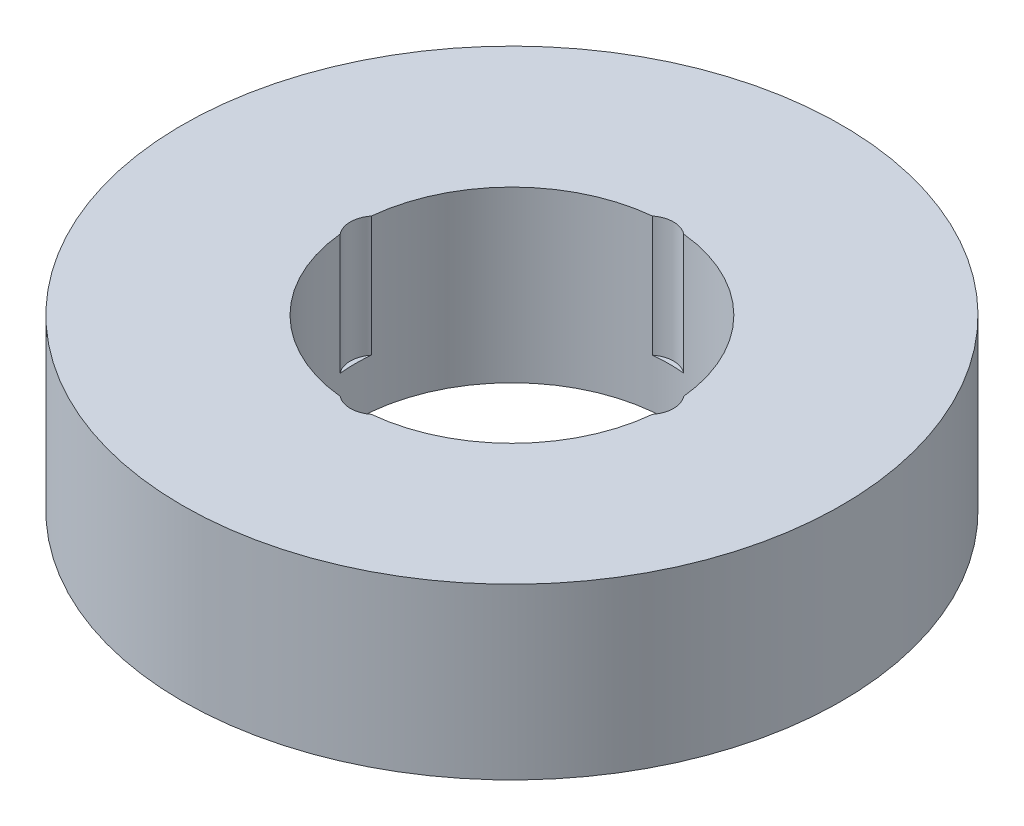
ISO-10303-21;
HEADER;
FILE_DESCRIPTION(('STEP AP214'),'2;1');
FILE_NAME('part.step','',(''),(''),'','','');
FILE_SCHEMA(('AUTOMOTIVE_DESIGN { 1 0 10303 214 1 1 1 1 }'));
ENDSEC;
DATA;
#1=APPLICATION_CONTEXT('core data for automotive mechanical design processes');
#2=APPLICATION_PROTOCOL_DEFINITION('international standard','automotive_design',2000,#1);
#3=PRODUCT_CONTEXT('',#1,'mechanical');
#4=PRODUCT('Part','Part','',(#3));
#5=PRODUCT_RELATED_PRODUCT_CATEGORY('part','',(#4));
#6=PRODUCT_DEFINITION_FORMATION('','',#4);
#7=PRODUCT_DEFINITION_CONTEXT('part definition',#1,'design');
#8=PRODUCT_DEFINITION('design','',#6,#7);
#9=PRODUCT_DEFINITION_SHAPE('','',#8);
#10=(LENGTH_UNIT() NAMED_UNIT(*) SI_UNIT(.MILLI.,.METRE.));
#11=(NAMED_UNIT(*) PLANE_ANGLE_UNIT() SI_UNIT($,.RADIAN.));
#12=(NAMED_UNIT(*) SI_UNIT($,.STERADIAN.) SOLID_ANGLE_UNIT());
#13=UNCERTAINTY_MEASURE_WITH_UNIT(LENGTH_MEASURE(1.E-05),#10,'distance_accuracy_value','');
#14=(GEOMETRIC_REPRESENTATION_CONTEXT(3) GLOBAL_UNCERTAINTY_ASSIGNED_CONTEXT((#13)) GLOBAL_UNIT_ASSIGNED_CONTEXT((#10,
#11,#12)) REPRESENTATION_CONTEXT('',''));
#15=CARTESIAN_POINT('',(0.,0.,0.));
#16=DIRECTION('',(0.,0.,1.));
#17=DIRECTION('',(1.,0.,0.));
#18=AXIS2_PLACEMENT_3D('',#15,#16,#17);
#19=CARTESIAN_POINT('',(0.,27.,0.));
#20=DIRECTION('',(0.,-1.,0.));
#21=DIRECTION('',(0.,0.,-1.));
#22=AXIS2_PLACEMENT_3D('',#19,#20,#21);
#23=CYLINDRICAL_SURFACE('',#22,52.5);
#24=CARTESIAN_POINT('',(0.,27.,0.));
#25=DIRECTION('',(0.,1.,0.));
#26=DIRECTION('',(0.,0.,1.));
#27=AXIS2_PLACEMENT_3D('',#24,#25,#26);
#28=CIRCLE('',#27,52.5);
#29=CARTESIAN_POINT('',(0.,27.,52.5));
#30=VERTEX_POINT('',#29);
#31=EDGE_CURVE('E148',#30,#30,#28,.T.);
#32=ORIENTED_EDGE('',*,*,#31,.F.);
#33=EDGE_LOOP('',(#32));
#34=FACE_BOUND('',#33,.T.);
#35=CARTESIAN_POINT('',(0.,0.,0.));
#36=DIRECTION('',(0.,1.,0.));
#37=DIRECTION('',(0.,0.,1.));
#38=AXIS2_PLACEMENT_3D('',#35,#36,#37);
#39=CIRCLE('',#38,52.5);
#40=CARTESIAN_POINT('',(0.,0.,52.5));
#41=VERTEX_POINT('',#40);
#42=EDGE_CURVE('E139',#41,#41,#39,.T.);
#43=ORIENTED_EDGE('',*,*,#42,.T.);
#44=EDGE_LOOP('',(#43));
#45=FACE_BOUND('',#44,.T.);
#46=ADVANCED_FACE('F39',(#34,#45),#23,.T.);
#47=CARTESIAN_POINT('',(0.,27.,0.));
#48=DIRECTION('',(0.,1.,0.));
#49=DIRECTION('',(0.,0.,1.));
#50=AXIS2_PLACEMENT_3D('',#47,#48,#49);
#51=PLANE('',#50);
#52=CARTESIAN_POINT('',(0.,27.,21.7381492281699));
#53=DIRECTION('',(0.,1.,0.));
#54=DIRECTION('',(1.,0.,0.));
#55=AXIS2_PLACEMENT_3D('',#52,#53,#54);
#56=CIRCLE('',#55,4.00310430508897);
#57=CARTESIAN_POINT('',(-2.48553550810672,27.,24.8761354160557));
#58=VERTEX_POINT('',#57);
#59=CARTESIAN_POINT('',(2.48553550810689,27.,24.8761354160557));
#60=VERTEX_POINT('',#59);
#61=EDGE_CURVE('E175',#58,#60,#56,.T.);
#62=ORIENTED_EDGE('',*,*,#61,.F.);
#63=CARTESIAN_POINT('',(0.,27.,0.));
#64=DIRECTION('',(0.,1.,0.));
#65=DIRECTION('',(0.,0.,1.));
#66=AXIS2_PLACEMENT_3D('',#63,#64,#65);
#67=CIRCLE('',#66,25.);
#68=CARTESIAN_POINT('',(-24.8761354160557,27.,2.4855355081068));
#69=VERTEX_POINT('',#68);
#70=EDGE_CURVE('E134',#69,#58,#67,.T.);
#71=ORIENTED_EDGE('',*,*,#70,.F.);
#72=CARTESIAN_POINT('',(-21.7381492281699,27.,0.));
#73=DIRECTION('',(0.,1.,0.));
#74=DIRECTION('',(0.,0.,1.));
#75=AXIS2_PLACEMENT_3D('',#72,#73,#74);
#76=CIRCLE('',#75,4.00310430508897);
#77=CARTESIAN_POINT('',(-24.8761354160557,27.,-2.4855355081068));
#78=VERTEX_POINT('',#77);
#79=EDGE_CURVE('E143',#78,#69,#76,.T.);
#80=ORIENTED_EDGE('',*,*,#79,.F.);
#81=CARTESIAN_POINT('',(-2.48553550810706,27.,-24.8761354160557));
#82=VERTEX_POINT('',#81);
#83=EDGE_CURVE('E123',#82,#78,#67,.T.);
#84=ORIENTED_EDGE('',*,*,#83,.F.);
#85=CARTESIAN_POINT('',(-2.27695027113427E-13,27.,-21.7381492281699));
#86=DIRECTION('',(0.,1.,0.));
#87=DIRECTION('',(-1.,0.,0.));
#88=AXIS2_PLACEMENT_3D('',#85,#86,#87);
#89=CIRCLE('',#88,4.00310430508897);
#90=CARTESIAN_POINT('',(2.48553550810654,27.,-24.8761354160557));
#91=VERTEX_POINT('',#90);
#92=EDGE_CURVE('E106',#91,#82,#89,.T.);
#93=ORIENTED_EDGE('',*,*,#92,.F.);
#94=CARTESIAN_POINT('',(24.8761354160557,27.,-2.4855355081068));
#95=VERTEX_POINT('',#94);
#96=EDGE_CURVE('E125',#95,#91,#67,.T.);
#97=ORIENTED_EDGE('',*,*,#96,.F.);
#98=CARTESIAN_POINT('',(21.7381492281699,27.,0.));
#99=DIRECTION('',(0.,1.,0.));
#100=DIRECTION('',(0.,0.,-1.));
#101=AXIS2_PLACEMENT_3D('',#98,#99,#100);
#102=CIRCLE('',#101,4.00310430508897);
#103=CARTESIAN_POINT('',(24.8761354160557,27.,2.4855355081068));
#104=VERTEX_POINT('',#103);
#105=EDGE_CURVE('E286',#104,#95,#102,.T.);
#106=ORIENTED_EDGE('',*,*,#105,.F.);
#107=EDGE_CURVE('E135',#60,#104,#67,.T.);
#108=ORIENTED_EDGE('',*,*,#107,.F.);
#109=EDGE_LOOP('',(#62,#71,#80,#84,#93,#97,#106,#108));
#110=FACE_BOUND('',#109,.T.);
#111=ORIENTED_EDGE('',*,*,#31,.T.);
#112=EDGE_LOOP('',(#111));
#113=FACE_BOUND('',#112,.T.);
#114=ADVANCED_FACE('F118',(#110,#113),#51,.T.);
#115=CARTESIAN_POINT('',(0.,0.,0.));
#116=DIRECTION('',(0.,1.,0.));
#117=DIRECTION('',(0.,0.,1.));
#118=AXIS2_PLACEMENT_3D('',#115,#116,#117);
#119=PLANE('',#118);
#120=CARTESIAN_POINT('',(0.,0.,0.));
#121=DIRECTION('',(0.,1.,0.));
#122=DIRECTION('',(0.,0.,1.));
#123=AXIS2_PLACEMENT_3D('',#120,#121,#122);
#124=CIRCLE('',#123,25.);
#125=CARTESIAN_POINT('',(0.,0.,25.));
#126=VERTEX_POINT('',#125);
#127=EDGE_CURVE('E136',#126,#126,#124,.T.);
#128=ORIENTED_EDGE('',*,*,#127,.T.);
#129=EDGE_LOOP('',(#128));
#130=FACE_BOUND('',#129,.T.);
#131=ORIENTED_EDGE('',*,*,#42,.F.);
#132=EDGE_LOOP('',(#131));
#133=FACE_BOUND('',#132,.T.);
#134=ADVANCED_FACE('F187',(#130,#133),#119,.F.);
#135=CARTESIAN_POINT('',(0.,27.,0.));
#136=DIRECTION('',(0.,-1.,0.));
#137=DIRECTION('',(0.,0.,-1.));
#138=AXIS2_PLACEMENT_3D('',#135,#136,#137);
#139=CYLINDRICAL_SURFACE('',#138,25.);
#140=DIRECTION('',(0.,1.,0.));
#141=VECTOR('',#140,1.);
#142=CARTESIAN_POINT('',(-2.48553550810674,17.4033158666836,24.8761354160557));
#143=LINE('',#142,#141);
#144=CARTESIAN_POINT('',(-2.48553550810672,7.8066317333672,24.8761354160557));
#145=VERTEX_POINT('',#144);
#146=EDGE_CURVE('E11',#145,#58,#143,.T.);
#147=ORIENTED_EDGE('',*,*,#146,.F.);
#148=CARTESIAN_POINT('',(0.,7.8066317333672,0.));
#149=DIRECTION('',(0.,1.,0.));
#150=DIRECTION('',(0.,0.,1.));
#151=AXIS2_PLACEMENT_3D('',#148,#149,#150);
#152=CIRCLE('',#151,25.);
#153=CARTESIAN_POINT('',(2.48553550810689,7.8066317333672,24.8761354160557));
#154=VERTEX_POINT('',#153);
#155=EDGE_CURVE('E170',#145,#154,#152,.T.);
#156=ORIENTED_EDGE('',*,*,#155,.T.);
#157=DIRECTION('',(0.,1.,0.));
#158=VECTOR('',#157,1.);
#159=CARTESIAN_POINT('',(2.48553550810691,17.4033158666836,24.8761354160557));
#160=LINE('',#159,#158);
#161=EDGE_CURVE('E46',#60,#154,#160,.F.);
#162=ORIENTED_EDGE('',*,*,#161,.F.);
#163=ORIENTED_EDGE('',*,*,#107,.T.);
#164=DIRECTION('',(0.,1.,0.));
#165=VECTOR('',#164,1.);
#166=CARTESIAN_POINT('',(24.8761354160557,17.4033158666836,2.48553550810683));
#167=LINE('',#166,#165);
#168=CARTESIAN_POINT('',(24.8761354160557,7.8066317333672,2.4855355081068));
#169=VERTEX_POINT('',#168);
#170=EDGE_CURVE('E164',#169,#104,#167,.T.);
#171=ORIENTED_EDGE('',*,*,#170,.F.);
#172=CARTESIAN_POINT('',(0.,7.8066317333672,0.));
#173=DIRECTION('',(0.,1.,0.));
#174=DIRECTION('',(0.,0.,1.));
#175=AXIS2_PLACEMENT_3D('',#172,#173,#174);
#176=CIRCLE('',#175,25.);
#177=CARTESIAN_POINT('',(24.8761354160557,7.8066317333672,-2.4855355081068));
#178=VERTEX_POINT('',#177);
#179=EDGE_CURVE('E115',#169,#178,#176,.T.);
#180=ORIENTED_EDGE('',*,*,#179,.T.);
#181=DIRECTION('',(0.,1.,0.));
#182=VECTOR('',#181,1.);
#183=CARTESIAN_POINT('',(24.8761354160557,17.4033158666836,-2.48553550810683));
#184=LINE('',#183,#182);
#185=EDGE_CURVE('E131',#95,#178,#184,.F.);
#186=ORIENTED_EDGE('',*,*,#185,.F.);
#187=ORIENTED_EDGE('',*,*,#96,.T.);
#188=DIRECTION('',(0.,1.,0.));
#189=VECTOR('',#188,1.);
#190=CARTESIAN_POINT('',(2.48553550810657,17.4033158666836,-24.8761354160557));
#191=LINE('',#190,#189);
#192=CARTESIAN_POINT('',(2.48553550810654,7.8066317333672,-24.8761354160557));
#193=VERTEX_POINT('',#192);
#194=EDGE_CURVE('E105',#193,#91,#191,.T.);
#195=ORIENTED_EDGE('',*,*,#194,.F.);
#196=CARTESIAN_POINT('',(0.,7.8066317333672,0.));
#197=DIRECTION('',(0.,1.,0.));
#198=DIRECTION('',(0.,0.,1.));
#199=AXIS2_PLACEMENT_3D('',#196,#197,#198);
#200=CIRCLE('',#199,25.);
#201=CARTESIAN_POINT('',(-2.48553550810706,7.8066317333672,-24.8761354160557));
#202=VERTEX_POINT('',#201);
#203=EDGE_CURVE('E159',#193,#202,#200,.T.);
#204=ORIENTED_EDGE('',*,*,#203,.T.);
#205=DIRECTION('',(0.,1.,0.));
#206=VECTOR('',#205,1.);
#207=CARTESIAN_POINT('',(-2.48553550810709,17.4033158666836,-24.8761354160556));
#208=LINE('',#207,#206);
#209=EDGE_CURVE('E114',#82,#202,#208,.F.);
#210=ORIENTED_EDGE('',*,*,#209,.F.);
#211=ORIENTED_EDGE('',*,*,#83,.T.);
#212=DIRECTION('',(0.,1.,0.));
#213=VECTOR('',#212,1.);
#214=CARTESIAN_POINT('',(-24.8761354160557,17.4033158666836,-2.48553550810683));
#215=LINE('',#214,#213);
#216=CARTESIAN_POINT('',(-24.8761354160557,7.8066317333672,-2.4855355081068));
#217=VERTEX_POINT('',#216);
#218=EDGE_CURVE('E160',#217,#78,#215,.T.);
#219=ORIENTED_EDGE('',*,*,#218,.F.);
#220=CARTESIAN_POINT('',(0.,7.8066317333672,0.));
#221=DIRECTION('',(0.,1.,0.));
#222=DIRECTION('',(0.,0.,1.));
#223=AXIS2_PLACEMENT_3D('',#220,#221,#222);
#224=CIRCLE('',#223,25.);
#225=CARTESIAN_POINT('',(-24.8761354160557,7.8066317333672,2.4855355081068));
#226=VERTEX_POINT('',#225);
#227=EDGE_CURVE('E149',#217,#226,#224,.T.);
#228=ORIENTED_EDGE('',*,*,#227,.T.);
#229=DIRECTION('',(0.,1.,0.));
#230=VECTOR('',#229,1.);
#231=CARTESIAN_POINT('',(-24.8761354160557,17.4033158666836,2.48553550810683));
#232=LINE('',#231,#230);
#233=EDGE_CURVE('E152',#69,#226,#232,.F.);
#234=ORIENTED_EDGE('',*,*,#233,.F.);
#235=ORIENTED_EDGE('',*,*,#70,.T.);
#236=EDGE_LOOP('',(#147,#156,#162,#163,#171,#180,#186,#187,#195,#204,#210,#211,#219,#228,#234,#235));
#237=FACE_BOUND('',#236,.T.);
#238=ORIENTED_EDGE('',*,*,#127,.F.);
#239=EDGE_LOOP('',(#238));
#240=FACE_BOUND('',#239,.T.);
#241=ADVANCED_FACE('F126',(#237,#240),#139,.F.);
#242=CARTESIAN_POINT('',(-21.7381492281699,7.8066317333672,0.));
#243=DIRECTION('',(0.,1.,0.));
#244=DIRECTION('',(0.,0.,1.));
#245=AXIS2_PLACEMENT_3D('',#242,#243,#244);
#246=CYLINDRICAL_SURFACE('',#245,4.00310430508897);
#247=ORIENTED_EDGE('',*,*,#218,.T.);
#248=ORIENTED_EDGE('',*,*,#79,.T.);
#249=ORIENTED_EDGE('',*,*,#233,.T.);
#250=CARTESIAN_POINT('',(-21.7381492281699,7.8066317333672,0.));
#251=DIRECTION('',(0.,1.,0.));
#252=DIRECTION('',(0.,0.,1.));
#253=AXIS2_PLACEMENT_3D('',#250,#251,#252);
#254=CIRCLE('',#253,4.00310430508897);
#255=EDGE_CURVE('E144',#217,#226,#254,.T.);
#256=ORIENTED_EDGE('',*,*,#255,.F.);
#257=EDGE_LOOP('',(#247,#248,#249,#256));
#258=FACE_BOUND('',#257,.T.);
#259=ADVANCED_FACE('F200',(#258),#246,.F.);
#260=CARTESIAN_POINT('',(-21.7381492281699,7.8066317333672,0.));
#261=DIRECTION('',(0.,1.,0.));
#262=DIRECTION('',(0.,0.,1.));
#263=AXIS2_PLACEMENT_3D('',#260,#261,#262);
#264=PLANE('',#263);
#265=ORIENTED_EDGE('',*,*,#255,.T.);
#266=ORIENTED_EDGE('',*,*,#227,.F.);
#267=EDGE_LOOP('',(#265,#266));
#268=FACE_BOUND('',#267,.T.);
#269=ADVANCED_FACE('F201',(#268),#264,.T.);
#270=CARTESIAN_POINT('',(-2.27695027113427E-13,7.8066317333672,-21.7381492281699));
#271=DIRECTION('',(0.,1.,0.));
#272=DIRECTION('',(0.,0.,1.));
#273=AXIS2_PLACEMENT_3D('',#270,#271,#272);
#274=CYLINDRICAL_SURFACE('',#273,4.00310430508897);
#275=ORIENTED_EDGE('',*,*,#194,.T.);
#276=ORIENTED_EDGE('',*,*,#92,.T.);
#277=ORIENTED_EDGE('',*,*,#209,.T.);
#278=CARTESIAN_POINT('',(-2.27695027113427E-13,7.8066317333672,-21.7381492281699));
#279=DIRECTION('',(0.,1.,0.));
#280=DIRECTION('',(-1.,0.,0.));
#281=AXIS2_PLACEMENT_3D('',#278,#279,#280);
#282=CIRCLE('',#281,4.00310430508897);
#283=EDGE_CURVE('E107',#193,#202,#282,.T.);
#284=ORIENTED_EDGE('',*,*,#283,.F.);
#285=EDGE_LOOP('',(#275,#276,#277,#284));
#286=FACE_BOUND('',#285,.T.);
#287=ADVANCED_FACE('F102',(#286),#274,.F.);
#288=CARTESIAN_POINT('',(-2.27695027113427E-13,7.8066317333672,-21.7381492281699));
#289=DIRECTION('',(0.,1.,0.));
#290=DIRECTION('',(-1.,0.,0.));
#291=AXIS2_PLACEMENT_3D('',#288,#289,#290);
#292=PLANE('',#291);
#293=ORIENTED_EDGE('',*,*,#283,.T.);
#294=ORIENTED_EDGE('',*,*,#203,.F.);
#295=EDGE_LOOP('',(#293,#294));
#296=FACE_BOUND('',#295,.T.);
#297=ADVANCED_FACE('F209',(#296),#292,.T.);
#298=CARTESIAN_POINT('',(21.7381492281699,7.8066317333672,0.));
#299=DIRECTION('',(0.,1.,0.));
#300=DIRECTION('',(0.,0.,1.));
#301=AXIS2_PLACEMENT_3D('',#298,#299,#300);
#302=CYLINDRICAL_SURFACE('',#301,4.00310430508897);
#303=ORIENTED_EDGE('',*,*,#170,.T.);
#304=ORIENTED_EDGE('',*,*,#105,.T.);
#305=ORIENTED_EDGE('',*,*,#185,.T.);
#306=CARTESIAN_POINT('',(21.7381492281699,7.8066317333672,0.));
#307=DIRECTION('',(0.,1.,0.));
#308=DIRECTION('',(0.,0.,-1.));
#309=AXIS2_PLACEMENT_3D('',#306,#307,#308);
#310=CIRCLE('',#309,4.00310430508897);
#311=EDGE_CURVE('E56',#169,#178,#310,.T.);
#312=ORIENTED_EDGE('',*,*,#311,.F.);
#313=EDGE_LOOP('',(#303,#304,#305,#312));
#314=FACE_BOUND('',#313,.T.);
#315=ADVANCED_FACE('F213',(#314),#302,.F.);
#316=CARTESIAN_POINT('',(21.7381492281699,7.8066317333672,0.));
#317=DIRECTION('',(0.,1.,0.));
#318=DIRECTION('',(0.,0.,-1.));
#319=AXIS2_PLACEMENT_3D('',#316,#317,#318);
#320=PLANE('',#319);
#321=ORIENTED_EDGE('',*,*,#311,.T.);
#322=ORIENTED_EDGE('',*,*,#179,.F.);
#323=EDGE_LOOP('',(#321,#322));
#324=FACE_BOUND('',#323,.T.);
#325=ADVANCED_FACE('F179',(#324),#320,.T.);
#326=CARTESIAN_POINT('',(0.,7.8066317333672,21.7381492281699));
#327=DIRECTION('',(0.,1.,0.));
#328=DIRECTION('',(0.,0.,1.));
#329=AXIS2_PLACEMENT_3D('',#326,#327,#328);
#330=CYLINDRICAL_SURFACE('',#329,4.00310430508897);
#331=ORIENTED_EDGE('',*,*,#146,.T.);
#332=ORIENTED_EDGE('',*,*,#61,.T.);
#333=ORIENTED_EDGE('',*,*,#161,.T.);
#334=CARTESIAN_POINT('',(0.,7.8066317333672,21.7381492281699));
#335=DIRECTION('',(0.,1.,0.));
#336=DIRECTION('',(1.,0.,0.));
#337=AXIS2_PLACEMENT_3D('',#334,#335,#336);
#338=CIRCLE('',#337,4.00310430508897);
#339=EDGE_CURVE('E55',#145,#154,#338,.T.);
#340=ORIENTED_EDGE('',*,*,#339,.F.);
#341=EDGE_LOOP('',(#331,#332,#333,#340));
#342=FACE_BOUND('',#341,.T.);
#343=ADVANCED_FACE('F171',(#342),#330,.F.);
#344=CARTESIAN_POINT('',(0.,7.8066317333672,21.7381492281699));
#345=DIRECTION('',(0.,1.,0.));
#346=DIRECTION('',(1.,0.,0.));
#347=AXIS2_PLACEMENT_3D('',#344,#345,#346);
#348=PLANE('',#347);
#349=ORIENTED_EDGE('',*,*,#339,.T.);
#350=ORIENTED_EDGE('',*,*,#155,.F.);
#351=EDGE_LOOP('',(#349,#350));
#352=FACE_BOUND('',#351,.T.);
#353=ADVANCED_FACE('F173',(#352),#348,.T.);
#354=CLOSED_SHELL('',(#46,#114,#134,#241,#259,#269,#287,#297,#315,#325,#343,#353));
#355=MANIFOLD_SOLID_BREP('B2',#354);
#356=ADVANCED_BREP_SHAPE_REPRESENTATION('',(#18,#355),#14);
#357=SHAPE_DEFINITION_REPRESENTATION(#9,#356);
ENDSEC;
END-ISO-10303-21;
